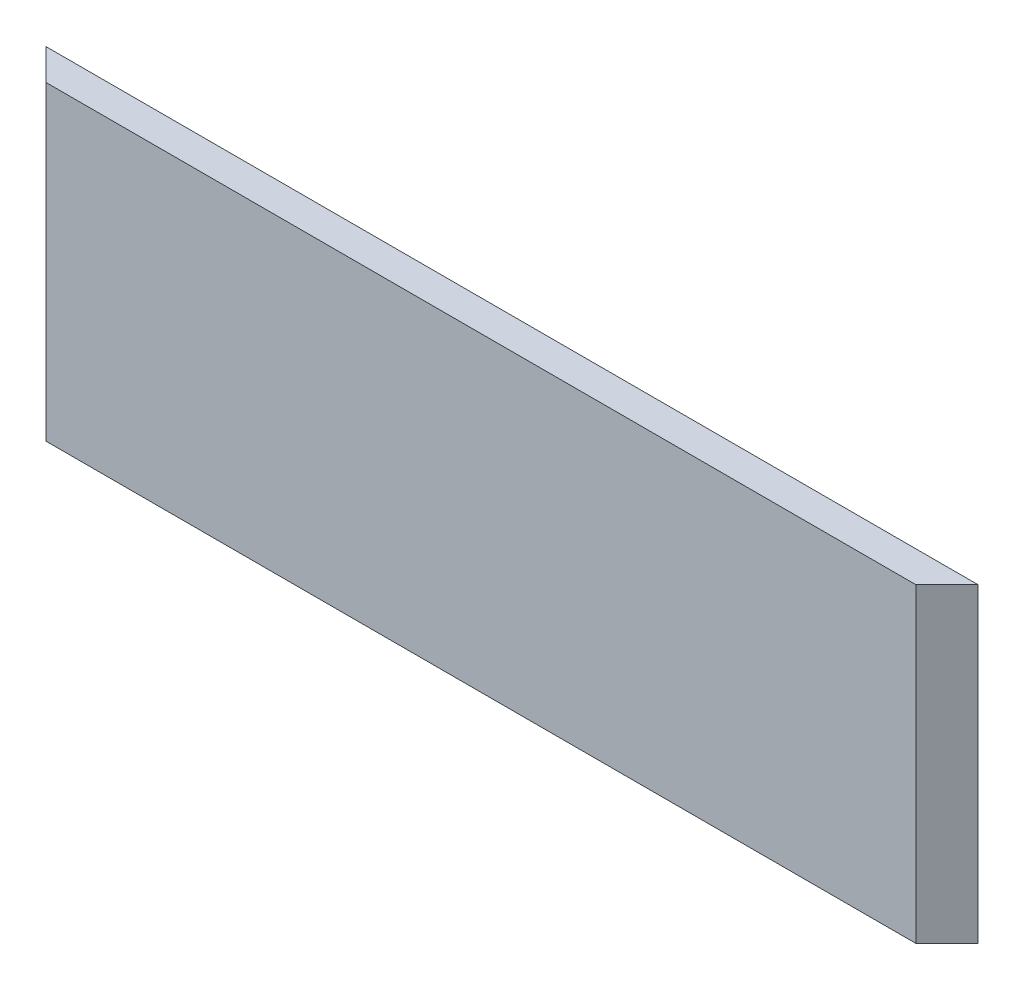
ISO-10303-21;
HEADER;
FILE_DESCRIPTION(('STEP AP214'),'2;1');
FILE_NAME('part.step','',(''),(''),'','','');
FILE_SCHEMA(('AUTOMOTIVE_DESIGN { 1 0 10303 214 1 1 1 1 }'));
ENDSEC;
DATA;
#1=APPLICATION_CONTEXT('core data for automotive mechanical design processes');
#2=APPLICATION_PROTOCOL_DEFINITION('international standard','automotive_design',2000,#1);
#3=PRODUCT_CONTEXT('',#1,'mechanical');
#4=PRODUCT('Part','Part','',(#3));
#5=PRODUCT_RELATED_PRODUCT_CATEGORY('part','',(#4));
#6=PRODUCT_DEFINITION_FORMATION('','',#4);
#7=PRODUCT_DEFINITION_CONTEXT('part definition',#1,'design');
#8=PRODUCT_DEFINITION('design','',#6,#7);
#9=PRODUCT_DEFINITION_SHAPE('','',#8);
#10=(LENGTH_UNIT() NAMED_UNIT(*) SI_UNIT(.MILLI.,.METRE.));
#11=(NAMED_UNIT(*) PLANE_ANGLE_UNIT() SI_UNIT($,.RADIAN.));
#12=(NAMED_UNIT(*) SI_UNIT($,.STERADIAN.) SOLID_ANGLE_UNIT());
#13=UNCERTAINTY_MEASURE_WITH_UNIT(LENGTH_MEASURE(1.E-05),#10,'distance_accuracy_value','');
#14=(GEOMETRIC_REPRESENTATION_CONTEXT(3) GLOBAL_UNCERTAINTY_ASSIGNED_CONTEXT((#13)) GLOBAL_UNIT_ASSIGNED_CONTEXT((#10,
#11,#12)) REPRESENTATION_CONTEXT('',''));
#15=CARTESIAN_POINT('',(0.,0.,0.));
#16=DIRECTION('',(0.,0.,1.));
#17=DIRECTION('',(1.,0.,0.));
#18=AXIS2_PLACEMENT_3D('',#15,#16,#17);
#19=CARTESIAN_POINT('',(0.,0.,5.));
#20=DIRECTION('',(0.,1.,0.));
#21=DIRECTION('',(0.,0.,1.));
#22=AXIS2_PLACEMENT_3D('',#19,#20,#21);
#23=PLANE('',#22);
#24=DIRECTION('',(1.,0.,0.));
#25=VECTOR('',#24,1.);
#26=CARTESIAN_POINT('',(0.,0.,5.));
#27=LINE('',#26,#25);
#28=CARTESIAN_POINT('',(5.,0.,5.));
#29=VERTEX_POINT('',#28);
#30=CARTESIAN_POINT('',(145.,0.,4.99999999999999));
#31=VERTEX_POINT('',#30);
#32=EDGE_CURVE('E390',#29,#31,#27,.T.);
#33=ORIENTED_EDGE('',*,*,#32,.F.);
#34=DIRECTION('',(0.707106781186546,0.,0.707106781186549));
#35=VECTOR('',#34,1.);
#36=CARTESIAN_POINT('',(5.,0.,5.));
#37=LINE('',#36,#35);
#38=CARTESIAN_POINT('',(0.,0.,0.));
#39=VERTEX_POINT('',#38);
#40=EDGE_CURVE('E355',#29,#39,#37,.F.);
#41=ORIENTED_EDGE('',*,*,#40,.T.);
#42=DIRECTION('',(1.,0.,0.));
#43=VECTOR('',#42,1.);
#44=CARTESIAN_POINT('',(0.,0.,0.));
#45=LINE('',#44,#43);
#46=CARTESIAN_POINT('',(150.,0.,0.));
#47=VERTEX_POINT('',#46);
#48=EDGE_CURVE('E388',#39,#47,#45,.T.);
#49=ORIENTED_EDGE('',*,*,#48,.T.);
#50=DIRECTION('',(0.707106781186544,0.,-0.707106781186551));
#51=VECTOR('',#50,1.);
#52=CARTESIAN_POINT('',(145.,0.,5.));
#53=LINE('',#52,#51);
#54=EDGE_CURVE('E415',#47,#31,#53,.F.);
#55=ORIENTED_EDGE('',*,*,#54,.T.);
#56=EDGE_LOOP('',(#33,#41,#49,#55));
#57=FACE_BOUND('',#56,.T.);
#58=ADVANCED_FACE('F348',(#57),#23,.F.);
#59=CARTESIAN_POINT('',(0.,50.,5.));
#60=DIRECTION('',(0.,-1.,0.));
#61=DIRECTION('',(0.,0.,-1.));
#62=AXIS2_PLACEMENT_3D('',#59,#60,#61);
#63=PLANE('',#62);
#64=DIRECTION('',(-1.,0.,0.));
#65=VECTOR('',#64,1.);
#66=CARTESIAN_POINT('',(0.,50.,0.));
#67=LINE('',#66,#65);
#68=CARTESIAN_POINT('',(150.,50.,0.));
#69=VERTEX_POINT('',#68);
#70=CARTESIAN_POINT('',(0.,50.,0.));
#71=VERTEX_POINT('',#70);
#72=EDGE_CURVE('E405',#69,#71,#67,.T.);
#73=ORIENTED_EDGE('',*,*,#72,.T.);
#74=DIRECTION('',(-0.707106781186546,0.,-0.707106781186549));
#75=VECTOR('',#74,1.);
#76=CARTESIAN_POINT('',(5.,50.,5.));
#77=LINE('',#76,#75);
#78=CARTESIAN_POINT('',(5.,50.,5.));
#79=VERTEX_POINT('',#78);
#80=EDGE_CURVE('E11',#71,#79,#77,.F.);
#81=ORIENTED_EDGE('',*,*,#80,.T.);
#82=DIRECTION('',(-1.,0.,0.));
#83=VECTOR('',#82,1.);
#84=CARTESIAN_POINT('',(0.,50.,5.));
#85=LINE('',#84,#83);
#86=CARTESIAN_POINT('',(145.,50.,4.99999999999999));
#87=VERTEX_POINT('',#86);
#88=EDGE_CURVE('E408',#87,#79,#85,.T.);
#89=ORIENTED_EDGE('',*,*,#88,.F.);
#90=DIRECTION('',(-0.707106781186544,0.,0.707106781186551));
#91=VECTOR('',#90,1.);
#92=CARTESIAN_POINT('',(145.,50.,5.));
#93=LINE('',#92,#91);
#94=EDGE_CURVE('E413',#87,#69,#93,.F.);
#95=ORIENTED_EDGE('',*,*,#94,.T.);
#96=EDGE_LOOP('',(#73,#81,#89,#95));
#97=FACE_BOUND('',#96,.T.);
#98=ADVANCED_FACE('F420',(#97),#63,.F.);
#99=CARTESIAN_POINT('',(0.,50.,5.));
#100=DIRECTION('',(0.,0.,-1.));
#101=DIRECTION('',(-1.,0.,0.));
#102=AXIS2_PLACEMENT_3D('',#99,#100,#101);
#103=PLANE('',#102);
#104=ORIENTED_EDGE('',*,*,#88,.T.);
#105=DIRECTION('',(0.,-1.,0.));
#106=VECTOR('',#105,1.);
#107=CARTESIAN_POINT('',(5.,50.,5.));
#108=LINE('',#107,#106);
#109=EDGE_CURVE('E391',#79,#29,#108,.T.);
#110=ORIENTED_EDGE('',*,*,#109,.T.);
#111=ORIENTED_EDGE('',*,*,#32,.T.);
#112=DIRECTION('',(0.,1.,0.));
#113=VECTOR('',#112,1.);
#114=CARTESIAN_POINT('',(145.,50.,5.));
#115=LINE('',#114,#113);
#116=EDGE_CURVE('E410',#31,#87,#115,.T.);
#117=ORIENTED_EDGE('',*,*,#116,.T.);
#118=EDGE_LOOP('',(#104,#110,#111,#117));
#119=FACE_BOUND('',#118,.T.);
#120=ADVANCED_FACE('F418',(#119),#103,.F.);
#121=CARTESIAN_POINT('',(0.,50.,0.));
#122=DIRECTION('',(0.,0.,-1.));
#123=DIRECTION('',(-1.,0.,0.));
#124=AXIS2_PLACEMENT_3D('',#121,#122,#123);
#125=PLANE('',#124);
#126=DIRECTION('',(0.,-1.,0.));
#127=VECTOR('',#126,1.);
#128=CARTESIAN_POINT('',(0.,0.,0.));
#129=LINE('',#128,#127);
#130=EDGE_CURVE('E396',#71,#39,#129,.T.);
#131=ORIENTED_EDGE('',*,*,#130,.F.);
#132=ORIENTED_EDGE('',*,*,#72,.F.);
#133=DIRECTION('',(0.,1.,0.));
#134=VECTOR('',#133,1.);
#135=CARTESIAN_POINT('',(150.,0.,0.));
#136=LINE('',#135,#134);
#137=EDGE_CURVE('E398',#47,#69,#136,.T.);
#138=ORIENTED_EDGE('',*,*,#137,.F.);
#139=ORIENTED_EDGE('',*,*,#48,.F.);
#140=EDGE_LOOP('',(#131,#132,#138,#139));
#141=FACE_BOUND('',#140,.T.);
#142=ADVANCED_FACE('F394',(#141),#125,.T.);
#143=CARTESIAN_POINT('',(145.,50.,5.));
#144=DIRECTION('',(-0.707106781186551,0.,-0.707106781186544));
#145=DIRECTION('',(-0.707106781186544,0.,0.707106781186551));
#146=AXIS2_PLACEMENT_3D('',#143,#144,#145);
#147=PLANE('',#146);
#148=ORIENTED_EDGE('',*,*,#54,.F.);
#149=ORIENTED_EDGE('',*,*,#137,.T.);
#150=ORIENTED_EDGE('',*,*,#94,.F.);
#151=ORIENTED_EDGE('',*,*,#116,.F.);
#152=EDGE_LOOP('',(#148,#149,#150,#151));
#153=FACE_BOUND('',#152,.T.);
#154=ADVANCED_FACE('F422',(#153),#147,.F.);
#155=CARTESIAN_POINT('',(5.,50.,5.));
#156=DIRECTION('',(0.707106781186549,0.,-0.707106781186546));
#157=DIRECTION('',(-0.707106781186546,0.,-0.707106781186549));
#158=AXIS2_PLACEMENT_3D('',#155,#156,#157);
#159=PLANE('',#158);
#160=ORIENTED_EDGE('',*,*,#80,.F.);
#161=ORIENTED_EDGE('',*,*,#130,.T.);
#162=ORIENTED_EDGE('',*,*,#40,.F.);
#163=ORIENTED_EDGE('',*,*,#109,.F.);
#164=EDGE_LOOP('',(#160,#161,#162,#163));
#165=FACE_BOUND('',#164,.T.);
#166=ADVANCED_FACE('F401',(#165),#159,.F.);
#167=CLOSED_SHELL('',(#58,#98,#120,#142,#154,#166));
#168=MANIFOLD_SOLID_BREP('B2',#167);
#169=ADVANCED_BREP_SHAPE_REPRESENTATION('',(#18,#168),#14);
#170=SHAPE_DEFINITION_REPRESENTATION(#9,#169);
ENDSEC;
END-ISO-10303-21;
